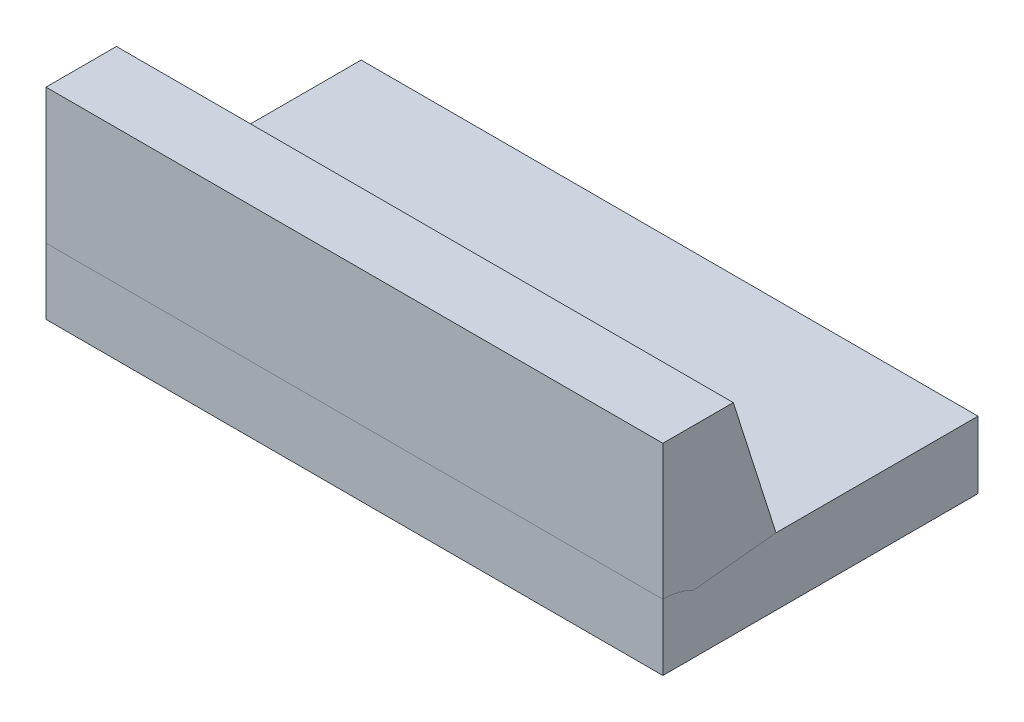
ISO-10303-21;
HEADER;
FILE_DESCRIPTION(('STEP AP214'),'2;1');
FILE_NAME('part.step','',(''),(''),'','','');
FILE_SCHEMA(('AUTOMOTIVE_DESIGN { 1 0 10303 214 1 1 1 1 }'));
ENDSEC;
DATA;
#1=APPLICATION_CONTEXT('core data for automotive mechanical design processes');
#2=APPLICATION_PROTOCOL_DEFINITION('international standard','automotive_design',2000,#1);
#3=PRODUCT_CONTEXT('',#1,'mechanical');
#4=PRODUCT('Part','Part','',(#3));
#5=PRODUCT_RELATED_PRODUCT_CATEGORY('part','',(#4));
#6=PRODUCT_DEFINITION_FORMATION('','',#4);
#7=PRODUCT_DEFINITION_CONTEXT('part definition',#1,'design');
#8=PRODUCT_DEFINITION('design','',#6,#7);
#9=PRODUCT_DEFINITION_SHAPE('','',#8);
#10=(LENGTH_UNIT() NAMED_UNIT(*) SI_UNIT(.MILLI.,.METRE.));
#11=(NAMED_UNIT(*) PLANE_ANGLE_UNIT() SI_UNIT($,.RADIAN.));
#12=(NAMED_UNIT(*) SI_UNIT($,.STERADIAN.) SOLID_ANGLE_UNIT());
#13=UNCERTAINTY_MEASURE_WITH_UNIT(LENGTH_MEASURE(1.E-05),#10,'distance_accuracy_value','');
#14=(GEOMETRIC_REPRESENTATION_CONTEXT(3) GLOBAL_UNCERTAINTY_ASSIGNED_CONTEXT((#13)) GLOBAL_UNIT_ASSIGNED_CONTEXT((#10,
#11,#12)) REPRESENTATION_CONTEXT('',''));
#15=CARTESIAN_POINT('',(0.,0.,0.));
#16=DIRECTION('',(0.,0.,1.));
#17=DIRECTION('',(1.,0.,0.));
#18=AXIS2_PLACEMENT_3D('',#15,#16,#17);
#19=CARTESIAN_POINT('',(22.0736196319018,15.,0.332030832005614));
#20=DIRECTION('',(1.,0.,0.));
#21=DIRECTION('',(0.,0.,-1.));
#22=AXIS2_PLACEMENT_3D('',#19,#20,#21);
#23=PLANE('',#22);
#24=DIRECTION('',(0.,0.,-1.));
#25=VECTOR('',#24,1.);
#26=CARTESIAN_POINT('',(22.0736196319018,5.,-12.7300613496932));
#27=LINE('',#26,#25);
#28=CARTESIAN_POINT('',(22.0736196319018,5.,2.33203083200561));
#29=VERTEX_POINT('',#28);
#30=CARTESIAN_POINT('',(22.0736196319018,5.,-12.7300613496932));
#31=VERTEX_POINT('',#30);
#32=EDGE_CURVE('E153',#29,#31,#27,.T.);
#33=ORIENTED_EDGE('',*,*,#32,.F.);
#34=DIRECTION('',(0.,-0.952829112072276,-0.303507303351266));
#35=VECTOR('',#34,1.);
#36=CARTESIAN_POINT('',(22.0736196319018,5.,2.33203083200561));
#37=LINE('',#36,#35);
#38=CARTESIAN_POINT('',(22.0736196319018,15.,5.51735860490687));
#39=VERTEX_POINT('',#38);
#40=EDGE_CURVE('E114',#39,#29,#37,.T.);
#41=ORIENTED_EDGE('',*,*,#40,.F.);
#42=DIRECTION('',(0.,0.,1.));
#43=VECTOR('',#42,1.);
#44=CARTESIAN_POINT('',(22.0736196319018,15.,0.332030832005614));
#45=LINE('',#44,#43);
#46=CARTESIAN_POINT('',(22.0736196319018,15.,10.7699386503067));
#47=VERTEX_POINT('',#46);
#48=EDGE_CURVE('E118',#39,#47,#45,.T.);
#49=ORIENTED_EDGE('',*,*,#48,.T.);
#50=DIRECTION('',(0.,-1.,0.));
#51=VECTOR('',#50,1.);
#52=CARTESIAN_POINT('',(22.0736196319018,15.,10.7699386503067));
#53=LINE('',#52,#51);
#54=CARTESIAN_POINT('',(22.0736196319018,4.93041842734741,10.7699386503067));
#55=VERTEX_POINT('',#54);
#56=EDGE_CURVE('E123',#47,#55,#53,.T.);
#57=ORIENTED_EDGE('',*,*,#56,.T.);
#58=CARTESIAN_POINT('',(22.0736196319018,0.,10.7699386503068));
#59=DIRECTION('',(1.,0.,0.));
#60=DIRECTION('',(0.,0.,-1.));
#61=AXIS2_PLACEMENT_3D('',#58,#59,#60);
#62=CIRCLE('',#61,4.93041842734741);
#63=CARTESIAN_POINT('',(22.0736196319018,0.,5.83952022295934));
#64=VERTEX_POINT('',#63);
#65=EDGE_CURVE('E174',#64,#55,#62,.T.);
#66=ORIENTED_EDGE('',*,*,#65,.F.);
#67=DIRECTION('',(0.,0.,-1.));
#68=VECTOR('',#67,1.);
#69=CARTESIAN_POINT('',(22.0736196319018,0.,-12.7300613496932));
#70=LINE('',#69,#68);
#71=CARTESIAN_POINT('',(22.0736196319018,0.,-12.7300613496932));
#72=VERTEX_POINT('',#71);
#73=EDGE_CURVE('E161',#64,#72,#70,.T.);
#74=ORIENTED_EDGE('',*,*,#73,.T.);
#75=DIRECTION('',(0.,-1.,0.));
#76=VECTOR('',#75,1.);
#77=CARTESIAN_POINT('',(22.0736196319018,5.,-12.7300613496932));
#78=LINE('',#77,#76);
#79=EDGE_CURVE('E166',#31,#72,#78,.T.);
#80=ORIENTED_EDGE('',*,*,#79,.F.);
#81=EDGE_LOOP('',(#33,#41,#49,#57,#66,#74,#80));
#82=FACE_BOUND('',#81,.T.);
#83=ADVANCED_FACE('F46',(#82),#23,.T.);
#84=CARTESIAN_POINT('',(-23.9263803680982,15.,0.332030832005614));
#85=DIRECTION('',(1.,0.,0.));
#86=DIRECTION('',(0.,0.,-1.));
#87=AXIS2_PLACEMENT_3D('',#84,#85,#86);
#88=PLANE('',#87);
#89=DIRECTION('',(0.,-0.952829112072276,-0.303507303351266));
#90=VECTOR('',#89,1.);
#91=CARTESIAN_POINT('',(-23.9263803680982,5.,2.33203083200563));
#92=LINE('',#91,#90);
#93=CARTESIAN_POINT('',(-23.9263803680982,15.,5.51735860490688));
#94=VERTEX_POINT('',#93);
#95=CARTESIAN_POINT('',(-23.9263803680982,5.,2.33203083200563));
#96=VERTEX_POINT('',#95);
#97=EDGE_CURVE('E105',#94,#96,#92,.T.);
#98=ORIENTED_EDGE('',*,*,#97,.T.);
#99=DIRECTION('',(0.,0.,1.));
#100=VECTOR('',#99,1.);
#101=CARTESIAN_POINT('',(-23.9263803680982,5.,-12.7300613496932));
#102=LINE('',#101,#100);
#103=CARTESIAN_POINT('',(-23.9263803680982,5.,-12.7300613496932));
#104=VERTEX_POINT('',#103);
#105=EDGE_CURVE('E151',#104,#96,#102,.T.);
#106=ORIENTED_EDGE('',*,*,#105,.F.);
#107=DIRECTION('',(0.,-1.,0.));
#108=VECTOR('',#107,1.);
#109=CARTESIAN_POINT('',(-23.9263803680982,5.,-12.7300613496932));
#110=LINE('',#109,#108);
#111=CARTESIAN_POINT('',(-23.9263803680982,0.,-12.7300613496932));
#112=VERTEX_POINT('',#111);
#113=EDGE_CURVE('E158',#104,#112,#110,.T.);
#114=ORIENTED_EDGE('',*,*,#113,.T.);
#115=DIRECTION('',(0.,0.,1.));
#116=VECTOR('',#115,1.);
#117=CARTESIAN_POINT('',(-23.9263803680982,0.,-12.7300613496932));
#118=LINE('',#117,#116);
#119=CARTESIAN_POINT('',(-23.9263803680982,0.,5.83952022295936));
#120=VERTEX_POINT('',#119);
#121=EDGE_CURVE('E142',#112,#120,#118,.T.);
#122=ORIENTED_EDGE('',*,*,#121,.T.);
#123=CARTESIAN_POINT('',(-23.9263803680982,0.,10.7699386503068));
#124=DIRECTION('',(1.,0.,0.));
#125=DIRECTION('',(0.,0.,-1.));
#126=AXIS2_PLACEMENT_3D('',#123,#124,#125);
#127=CIRCLE('',#126,4.93041842734741);
#128=CARTESIAN_POINT('',(-23.9263803680982,4.93041842734741,10.7699386503068));
#129=VERTEX_POINT('',#128);
#130=EDGE_CURVE('E60',#120,#129,#127,.T.);
#131=ORIENTED_EDGE('',*,*,#130,.T.);
#132=DIRECTION('',(0.,-1.,0.));
#133=VECTOR('',#132,1.);
#134=CARTESIAN_POINT('',(-23.9263803680982,15.,10.7699386503068));
#135=LINE('',#134,#133);
#136=CARTESIAN_POINT('',(-23.9263803680982,15.,10.7699386503068));
#137=VERTEX_POINT('',#136);
#138=EDGE_CURVE('E53',#137,#129,#135,.T.);
#139=ORIENTED_EDGE('',*,*,#138,.F.);
#140=DIRECTION('',(0.,0.,1.));
#141=VECTOR('',#140,1.);
#142=CARTESIAN_POINT('',(-23.9263803680982,15.,0.332030832005614));
#143=LINE('',#142,#141);
#144=EDGE_CURVE('E67',#94,#137,#143,.T.);
#145=ORIENTED_EDGE('',*,*,#144,.F.);
#146=EDGE_LOOP('',(#98,#106,#114,#122,#131,#139,#145));
#147=FACE_BOUND('',#146,.T.);
#148=ADVANCED_FACE('F120',(#147),#88,.F.);
#149=CARTESIAN_POINT('',(22.0736196319018,15.,10.7699386503067));
#150=DIRECTION('',(0.,0.,1.));
#151=DIRECTION('',(1.,0.,0.));
#152=AXIS2_PLACEMENT_3D('',#149,#150,#151);
#153=PLANE('',#152);
#154=DIRECTION('',(1.,0.,0.));
#155=VECTOR('',#154,1.);
#156=CARTESIAN_POINT('',(-23.9263803680982,4.93041842734741,10.7699386503068));
#157=LINE('',#156,#155);
#158=EDGE_CURVE('E135',#55,#129,#157,.F.);
#159=ORIENTED_EDGE('',*,*,#158,.F.);
#160=ORIENTED_EDGE('',*,*,#56,.F.);
#161=DIRECTION('',(-1.,0.,0.));
#162=VECTOR('',#161,1.);
#163=CARTESIAN_POINT('',(22.0736196319018,15.,10.7699386503067));
#164=LINE('',#163,#162);
#165=EDGE_CURVE('E124',#47,#137,#164,.T.);
#166=ORIENTED_EDGE('',*,*,#165,.T.);
#167=ORIENTED_EDGE('',*,*,#138,.T.);
#168=EDGE_LOOP('',(#159,#160,#166,#167));
#169=FACE_BOUND('',#168,.T.);
#170=ADVANCED_FACE('F173',(#169),#153,.T.);
#171=CARTESIAN_POINT('',(0.,15.,0.));
#172=DIRECTION('',(0.,-1.,0.));
#173=DIRECTION('',(0.,0.,-1.));
#174=AXIS2_PLACEMENT_3D('',#171,#172,#173);
#175=PLANE('',#174);
#176=ORIENTED_EDGE('',*,*,#48,.F.);
#177=DIRECTION('',(1.,0.,0.));
#178=VECTOR('',#177,1.);
#179=CARTESIAN_POINT('',(-23.9263803680982,15.,5.51735860490688));
#180=LINE('',#179,#178);
#181=EDGE_CURVE('E108',#94,#39,#180,.T.);
#182=ORIENTED_EDGE('',*,*,#181,.F.);
#183=ORIENTED_EDGE('',*,*,#144,.T.);
#184=ORIENTED_EDGE('',*,*,#165,.F.);
#185=EDGE_LOOP('',(#176,#182,#183,#184));
#186=FACE_BOUND('',#185,.T.);
#187=ADVANCED_FACE('F117',(#186),#175,.F.);
#188=CARTESIAN_POINT('',(0.,5.,0.));
#189=DIRECTION('',(0.,1.,0.));
#190=DIRECTION('',(0.,0.,1.));
#191=AXIS2_PLACEMENT_3D('',#188,#189,#190);
#192=PLANE('',#191);
#193=CARTESIAN_POINT('',(17.3171528335706,5.,-0.321999767210202));
#194=DIRECTION('',(0.,1.,0.));
#195=DIRECTION('',(0.,0.,1.));
#196=AXIS2_PLACEMENT_3D('',#193,#194,#195);
#197=CIRCLE('',#196,2.00000000000764);
#198=CARTESIAN_POINT('',(17.3171528335706,5.,1.67800023279744));
#199=VERTEX_POINT('',#198);
#200=EDGE_CURVE('E138',#199,#199,#197,.T.);
#201=ORIENTED_EDGE('',*,*,#200,.F.);
#202=EDGE_LOOP('',(#201));
#203=FACE_BOUND('',#202,.T.);
#204=CARTESIAN_POINT('',(-11.8074427328378,5.,-0.541888977142968));
#205=DIRECTION('',(0.,1.,0.));
#206=DIRECTION('',(0.,0.,1.));
#207=AXIS2_PLACEMENT_3D('',#204,#205,#206);
#208=CIRCLE('',#207,2.);
#209=CARTESIAN_POINT('',(-11.8074427328378,5.,1.45811102285704));
#210=VERTEX_POINT('',#209);
#211=EDGE_CURVE('E134',#210,#210,#208,.T.);
#212=ORIENTED_EDGE('',*,*,#211,.F.);
#213=EDGE_LOOP('',(#212));
#214=FACE_BOUND('',#213,.T.);
#215=DIRECTION('',(1.,0.,0.));
#216=VECTOR('',#215,1.);
#217=CARTESIAN_POINT('',(-23.9263803680982,5.,2.33203083200563));
#218=LINE('',#217,#216);
#219=EDGE_CURVE('E111',#96,#29,#218,.T.);
#220=ORIENTED_EDGE('',*,*,#219,.T.);
#221=ORIENTED_EDGE('',*,*,#32,.T.);
#222=DIRECTION('',(-1.,0.,0.));
#223=VECTOR('',#222,1.);
#224=CARTESIAN_POINT('',(-23.9263803680982,5.,-12.7300613496932));
#225=LINE('',#224,#223);
#226=EDGE_CURVE('E156',#31,#104,#225,.T.);
#227=ORIENTED_EDGE('',*,*,#226,.T.);
#228=ORIENTED_EDGE('',*,*,#105,.T.);
#229=EDGE_LOOP('',(#220,#221,#227,#228));
#230=FACE_BOUND('',#229,.T.);
#231=ADVANCED_FACE('F179',(#203,#214,#230),#192,.T.);
#232=CARTESIAN_POINT('',(-23.9263803680982,5.,-12.7300613496932));
#233=DIRECTION('',(0.,0.,1.));
#234=DIRECTION('',(1.,0.,0.));
#235=AXIS2_PLACEMENT_3D('',#232,#233,#234);
#236=PLANE('',#235);
#237=DIRECTION('',(-1.,0.,0.));
#238=VECTOR('',#237,1.);
#239=CARTESIAN_POINT('',(-23.9263803680982,0.,-12.7300613496932));
#240=LINE('',#239,#238);
#241=EDGE_CURVE('E154',#72,#112,#240,.T.);
#242=ORIENTED_EDGE('',*,*,#241,.T.);
#243=ORIENTED_EDGE('',*,*,#113,.F.);
#244=ORIENTED_EDGE('',*,*,#226,.F.);
#245=ORIENTED_EDGE('',*,*,#79,.T.);
#246=EDGE_LOOP('',(#242,#243,#244,#245));
#247=FACE_BOUND('',#246,.T.);
#248=ADVANCED_FACE('F190',(#247),#236,.F.);
#249=CARTESIAN_POINT('',(0.,0.,0.));
#250=DIRECTION('',(0.,1.,0.));
#251=DIRECTION('',(0.,0.,1.));
#252=AXIS2_PLACEMENT_3D('',#249,#250,#251);
#253=PLANE('',#252);
#254=CARTESIAN_POINT('',(17.3171528335706,0.,-0.321999767210202));
#255=DIRECTION('',(0.,1.,0.));
#256=DIRECTION('',(0.,0.,1.));
#257=AXIS2_PLACEMENT_3D('',#254,#255,#256);
#258=CIRCLE('',#257,2.00000000000764);
#259=CARTESIAN_POINT('',(17.3171528335706,0.,1.67800023279744));
#260=VERTEX_POINT('',#259);
#261=EDGE_CURVE('E136',#260,#260,#258,.T.);
#262=ORIENTED_EDGE('',*,*,#261,.T.);
#263=EDGE_LOOP('',(#262));
#264=FACE_BOUND('',#263,.T.);
#265=CARTESIAN_POINT('',(-11.8074427328378,0.,-0.541888977142968));
#266=DIRECTION('',(0.,1.,0.));
#267=DIRECTION('',(0.,0.,1.));
#268=AXIS2_PLACEMENT_3D('',#265,#266,#267);
#269=CIRCLE('',#268,2.);
#270=CARTESIAN_POINT('',(-11.8074427328378,0.,1.45811102285704));
#271=VERTEX_POINT('',#270);
#272=EDGE_CURVE('E132',#271,#271,#269,.T.);
#273=ORIENTED_EDGE('',*,*,#272,.T.);
#274=EDGE_LOOP('',(#273));
#275=FACE_BOUND('',#274,.T.);
#276=ORIENTED_EDGE('',*,*,#73,.F.);
#277=DIRECTION('',(1.,0.,0.));
#278=VECTOR('',#277,1.);
#279=CARTESIAN_POINT('',(-23.9263803680982,0.,5.83952022295936));
#280=LINE('',#279,#278);
#281=EDGE_CURVE('E12',#64,#120,#280,.F.);
#282=ORIENTED_EDGE('',*,*,#281,.T.);
#283=ORIENTED_EDGE('',*,*,#121,.F.);
#284=ORIENTED_EDGE('',*,*,#241,.F.);
#285=EDGE_LOOP('',(#276,#282,#283,#284));
#286=FACE_BOUND('',#285,.T.);
#287=ADVANCED_FACE('F188',(#264,#275,#286),#253,.F.);
#288=CARTESIAN_POINT('',(-11.8074427328378,15.,-0.541888977142968));
#289=DIRECTION('',(0.,-1.,0.));
#290=DIRECTION('',(0.,0.,-1.));
#291=AXIS2_PLACEMENT_3D('',#288,#289,#290);
#292=CYLINDRICAL_SURFACE('',#291,2.);
#293=ORIENTED_EDGE('',*,*,#272,.F.);
#294=EDGE_LOOP('',(#293));
#295=FACE_BOUND('',#294,.T.);
#296=ORIENTED_EDGE('',*,*,#211,.T.);
#297=EDGE_LOOP('',(#296));
#298=FACE_BOUND('',#297,.T.);
#299=ADVANCED_FACE('F198',(#295,#298),#292,.F.);
#300=CARTESIAN_POINT('',(17.3171528335706,15.,-0.321999767210202));
#301=DIRECTION('',(0.,-1.,0.));
#302=DIRECTION('',(0.,0.,-1.));
#303=AXIS2_PLACEMENT_3D('',#300,#301,#302);
#304=CYLINDRICAL_SURFACE('',#303,2.00000000000764);
#305=ORIENTED_EDGE('',*,*,#261,.F.);
#306=EDGE_LOOP('',(#305));
#307=FACE_BOUND('',#306,.T.);
#308=ORIENTED_EDGE('',*,*,#200,.T.);
#309=EDGE_LOOP('',(#308));
#310=FACE_BOUND('',#309,.T.);
#311=ADVANCED_FACE('F232',(#307,#310),#304,.F.);
#312=CARTESIAN_POINT('',(-23.9263803680982,0.,10.7699386503068));
#313=DIRECTION('',(1.,0.,0.));
#314=DIRECTION('',(0.,0.,-1.));
#315=AXIS2_PLACEMENT_3D('',#312,#313,#314);
#316=CYLINDRICAL_SURFACE('',#315,4.93041842734741);
#317=ORIENTED_EDGE('',*,*,#158,.T.);
#318=ORIENTED_EDGE('',*,*,#130,.F.);
#319=ORIENTED_EDGE('',*,*,#281,.F.);
#320=ORIENTED_EDGE('',*,*,#65,.T.);
#321=EDGE_LOOP('',(#317,#318,#319,#320));
#322=FACE_BOUND('',#321,.T.);
#323=ADVANCED_FACE('F189',(#322),#316,.F.);
#324=CARTESIAN_POINT('',(-23.9263803680982,5.,2.33203083200563));
#325=DIRECTION('',(0.,-0.303507303351266,0.952829112072276));
#326=DIRECTION('',(0.,-0.952829112072276,-0.303507303351266));
#327=AXIS2_PLACEMENT_3D('',#324,#325,#326);
#328=PLANE('',#327);
#329=ORIENTED_EDGE('',*,*,#40,.T.);
#330=ORIENTED_EDGE('',*,*,#219,.F.);
#331=ORIENTED_EDGE('',*,*,#97,.F.);
#332=ORIENTED_EDGE('',*,*,#181,.T.);
#333=EDGE_LOOP('',(#329,#330,#331,#332));
#334=FACE_BOUND('',#333,.T.);
#335=ADVANCED_FACE('F107',(#334),#328,.F.);
#336=CLOSED_SHELL('',(#83,#148,#170,#187,#231,#248,#287,#299,#311,#323,#335));
#337=MANIFOLD_SOLID_BREP('B2',#336);
#338=CARTESIAN_POINT('',(-23.9263803680982,5.,-12.7300613496932));
#339=DIRECTION('',(1.,0.,0.));
#340=DIRECTION('',(0.,0.,-1.));
#341=AXIS2_PLACEMENT_3D('',#338,#339,#340);
#342=PLANE('',#341);
#343=DIRECTION('',(0.,0.,1.));
#344=VECTOR('',#343,1.);
#345=CARTESIAN_POINT('',(-23.9263803680982,0.,-12.7300613496932));
#346=LINE('',#345,#344);
#347=CARTESIAN_POINT('',(-23.9263803680982,0.,-12.7300613496932));
#348=VERTEX_POINT('',#347);
#349=CARTESIAN_POINT('',(-23.9263803680982,0.,10.7699386503068));
#350=VERTEX_POINT('',#349);
#351=EDGE_CURVE('E364',#348,#350,#346,.T.);
#352=ORIENTED_EDGE('',*,*,#351,.T.);
#353=DIRECTION('',(0.,-1.,0.));
#354=VECTOR('',#353,1.);
#355=CARTESIAN_POINT('',(-23.9263803680982,5.,10.7699386503068));
#356=LINE('',#355,#354);
#357=CARTESIAN_POINT('',(-23.9263803680982,5.,10.7699386503068));
#358=VERTEX_POINT('',#357);
#359=EDGE_CURVE('E44',#358,#350,#356,.T.);
#360=ORIENTED_EDGE('',*,*,#359,.F.);
#361=DIRECTION('',(0.,0.,1.));
#362=VECTOR('',#361,1.);
#363=CARTESIAN_POINT('',(-23.9263803680982,5.,-12.7300613496932));
#364=LINE('',#363,#362);
#365=CARTESIAN_POINT('',(-23.9263803680982,5.,-12.7300613496932));
#366=VERTEX_POINT('',#365);
#367=EDGE_CURVE('E352',#366,#358,#364,.T.);
#368=ORIENTED_EDGE('',*,*,#367,.F.);
#369=DIRECTION('',(0.,-1.,0.));
#370=VECTOR('',#369,1.);
#371=CARTESIAN_POINT('',(-23.9263803680982,5.,-12.7300613496932));
#372=LINE('',#371,#370);
#373=EDGE_CURVE('E360',#366,#348,#372,.T.);
#374=ORIENTED_EDGE('',*,*,#373,.T.);
#375=EDGE_LOOP('',(#352,#360,#368,#374));
#376=FACE_BOUND('',#375,.T.);
#377=ADVANCED_FACE('F301',(#376),#342,.F.);
#378=CARTESIAN_POINT('',(-23.9263803680982,5.,10.7699386503068));
#379=DIRECTION('',(0.,0.,-1.));
#380=DIRECTION('',(-1.,0.,0.));
#381=AXIS2_PLACEMENT_3D('',#378,#379,#380);
#382=PLANE('',#381);
#383=DIRECTION('',(1.,0.,0.));
#384=VECTOR('',#383,1.);
#385=CARTESIAN_POINT('',(-23.9263803680982,0.,10.7699386503068));
#386=LINE('',#385,#384);
#387=CARTESIAN_POINT('',(22.0736196319018,0.,10.7699386503068));
#388=VERTEX_POINT('',#387);
#389=EDGE_CURVE('E356',#350,#388,#386,.T.);
#390=ORIENTED_EDGE('',*,*,#389,.T.);
#391=DIRECTION('',(0.,-1.,0.));
#392=VECTOR('',#391,1.);
#393=CARTESIAN_POINT('',(22.0736196319018,5.,10.7699386503068));
#394=LINE('',#393,#392);
#395=CARTESIAN_POINT('',(22.0736196319018,5.,10.7699386503068));
#396=VERTEX_POINT('',#395);
#397=EDGE_CURVE('E309',#396,#388,#394,.T.);
#398=ORIENTED_EDGE('',*,*,#397,.F.);
#399=DIRECTION('',(1.,0.,0.));
#400=VECTOR('',#399,1.);
#401=CARTESIAN_POINT('',(-23.9263803680982,5.,10.7699386503068));
#402=LINE('',#401,#400);
#403=EDGE_CURVE('E347',#358,#396,#402,.T.);
#404=ORIENTED_EDGE('',*,*,#403,.F.);
#405=ORIENTED_EDGE('',*,*,#359,.T.);
#406=EDGE_LOOP('',(#390,#398,#404,#405));
#407=FACE_BOUND('',#406,.T.);
#408=ADVANCED_FACE('F355',(#407),#382,.F.);
#409=CARTESIAN_POINT('',(22.0736196319018,5.,-12.7300613496932));
#410=DIRECTION('',(-1.,0.,0.));
#411=DIRECTION('',(0.,0.,1.));
#412=AXIS2_PLACEMENT_3D('',#409,#410,#411);
#413=PLANE('',#412);
#414=DIRECTION('',(0.,0.,-1.));
#415=VECTOR('',#414,1.);
#416=CARTESIAN_POINT('',(22.0736196319018,0.,-12.7300613496932));
#417=LINE('',#416,#415);
#418=CARTESIAN_POINT('',(22.0736196319018,0.,-12.7300613496932));
#419=VERTEX_POINT('',#418);
#420=EDGE_CURVE('E334',#388,#419,#417,.T.);
#421=ORIENTED_EDGE('',*,*,#420,.T.);
#422=DIRECTION('',(0.,-1.,0.));
#423=VECTOR('',#422,1.);
#424=CARTESIAN_POINT('',(22.0736196319018,5.,-12.7300613496932));
#425=LINE('',#424,#423);
#426=CARTESIAN_POINT('',(22.0736196319018,5.,-12.7300613496932));
#427=VERTEX_POINT('',#426);
#428=EDGE_CURVE('E357',#427,#419,#425,.T.);
#429=ORIENTED_EDGE('',*,*,#428,.F.);
#430=DIRECTION('',(0.,0.,-1.));
#431=VECTOR('',#430,1.);
#432=CARTESIAN_POINT('',(22.0736196319018,5.,-12.7300613496932));
#433=LINE('',#432,#431);
#434=EDGE_CURVE('E350',#396,#427,#433,.T.);
#435=ORIENTED_EDGE('',*,*,#434,.F.);
#436=ORIENTED_EDGE('',*,*,#397,.T.);
#437=EDGE_LOOP('',(#421,#429,#435,#436));
#438=FACE_BOUND('',#437,.T.);
#439=ADVANCED_FACE('F358',(#438),#413,.F.);
#440=CARTESIAN_POINT('',(-23.9263803680982,5.,-12.7300613496932));
#441=DIRECTION('',(0.,0.,1.));
#442=DIRECTION('',(1.,0.,0.));
#443=AXIS2_PLACEMENT_3D('',#440,#441,#442);
#444=PLANE('',#443);
#445=DIRECTION('',(-1.,0.,0.));
#446=VECTOR('',#445,1.);
#447=CARTESIAN_POINT('',(-23.9263803680982,0.,-12.7300613496932));
#448=LINE('',#447,#446);
#449=EDGE_CURVE('E340',#419,#348,#448,.T.);
#450=ORIENTED_EDGE('',*,*,#449,.T.);
#451=ORIENTED_EDGE('',*,*,#373,.F.);
#452=DIRECTION('',(-1.,0.,0.));
#453=VECTOR('',#452,1.);
#454=CARTESIAN_POINT('',(-23.9263803680982,5.,-12.7300613496932));
#455=LINE('',#454,#453);
#456=EDGE_CURVE('E317',#427,#366,#455,.T.);
#457=ORIENTED_EDGE('',*,*,#456,.F.);
#458=ORIENTED_EDGE('',*,*,#428,.T.);
#459=EDGE_LOOP('',(#450,#451,#457,#458));
#460=FACE_BOUND('',#459,.T.);
#461=ADVANCED_FACE('F371',(#460),#444,.F.);
#462=CARTESIAN_POINT('',(0.,5.,0.));
#463=DIRECTION('',(0.,1.,0.));
#464=DIRECTION('',(0.,0.,1.));
#465=AXIS2_PLACEMENT_3D('',#462,#463,#464);
#466=PLANE('',#465);
#467=ORIENTED_EDGE('',*,*,#367,.T.);
#468=ORIENTED_EDGE('',*,*,#403,.T.);
#469=ORIENTED_EDGE('',*,*,#434,.T.);
#470=ORIENTED_EDGE('',*,*,#456,.T.);
#471=EDGE_LOOP('',(#467,#468,#469,#470));
#472=FACE_BOUND('',#471,.T.);
#473=ADVANCED_FACE('F348',(#472),#466,.T.);
#474=CARTESIAN_POINT('',(0.,0.,0.));
#475=DIRECTION('',(0.,1.,0.));
#476=DIRECTION('',(0.,0.,1.));
#477=AXIS2_PLACEMENT_3D('',#474,#475,#476);
#478=PLANE('',#477);
#479=ORIENTED_EDGE('',*,*,#351,.F.);
#480=ORIENTED_EDGE('',*,*,#449,.F.);
#481=ORIENTED_EDGE('',*,*,#420,.F.);
#482=ORIENTED_EDGE('',*,*,#389,.F.);
#483=EDGE_LOOP('',(#479,#480,#481,#482));
#484=FACE_BOUND('',#483,.T.);
#485=ADVANCED_FACE('F374',(#484),#478,.F.);
#486=CLOSED_SHELL('',(#377,#408,#439,#461,#473,#485));
#487=MANIFOLD_SOLID_BREP('B6_NOT_SHOWN',#486);
#488=ADVANCED_BREP_SHAPE_REPRESENTATION('',(#18,#337,#487),#14);
#489=SHAPE_DEFINITION_REPRESENTATION(#9,#488);
ENDSEC;
END-ISO-10303-21;
